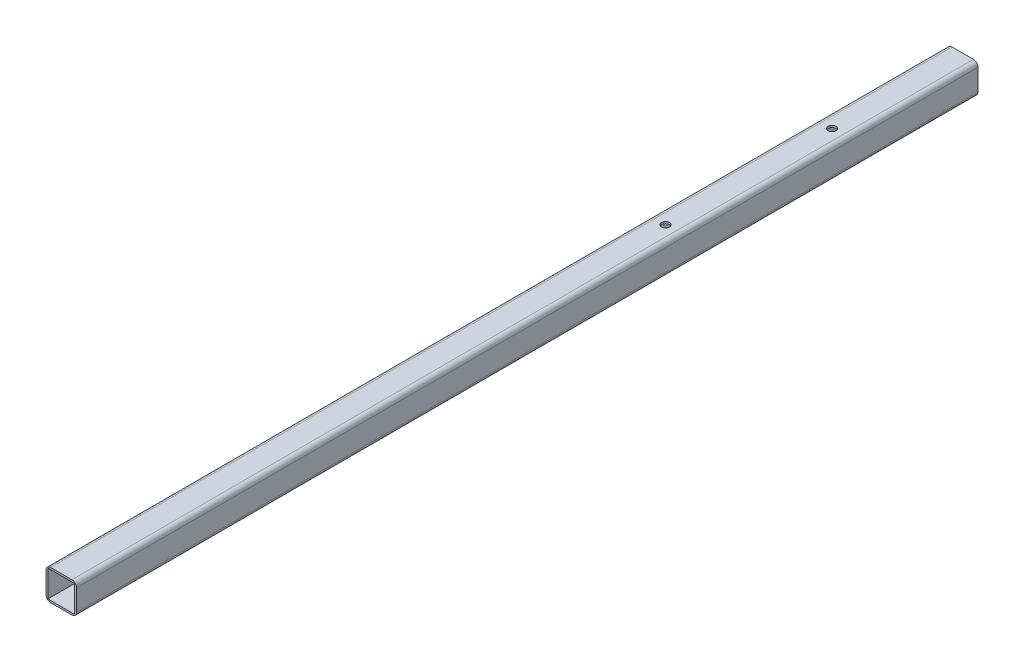
ISO-10303-21;
HEADER;
FILE_DESCRIPTION(('STEP AP214'),'2;1');
FILE_NAME('part.step','',(''),(''),'','','');
FILE_SCHEMA(('AUTOMOTIVE_DESIGN { 1 0 10303 214 1 1 1 1 }'));
ENDSEC;
DATA;
#1=APPLICATION_CONTEXT('core data for automotive mechanical design processes');
#2=APPLICATION_PROTOCOL_DEFINITION('international standard','automotive_design',2000,#1);
#3=PRODUCT_CONTEXT('',#1,'mechanical');
#4=PRODUCT('Part','Part','',(#3));
#5=PRODUCT_RELATED_PRODUCT_CATEGORY('part','',(#4));
#6=PRODUCT_DEFINITION_FORMATION('','',#4);
#7=PRODUCT_DEFINITION_CONTEXT('part definition',#1,'design');
#8=PRODUCT_DEFINITION('design','',#6,#7);
#9=PRODUCT_DEFINITION_SHAPE('','',#8);
#10=(LENGTH_UNIT() NAMED_UNIT(*) SI_UNIT(.MILLI.,.METRE.));
#11=(NAMED_UNIT(*) PLANE_ANGLE_UNIT() SI_UNIT($,.RADIAN.));
#12=(NAMED_UNIT(*) SI_UNIT($,.STERADIAN.) SOLID_ANGLE_UNIT());
#13=UNCERTAINTY_MEASURE_WITH_UNIT(LENGTH_MEASURE(1.E-05),#10,'distance_accuracy_value','');
#14=(GEOMETRIC_REPRESENTATION_CONTEXT(3) GLOBAL_UNCERTAINTY_ASSIGNED_CONTEXT((#13)) GLOBAL_UNIT_ASSIGNED_CONTEXT((#10,
#11,#12)) REPRESENTATION_CONTEXT('',''));
#15=CARTESIAN_POINT('',(0.,0.,0.));
#16=DIRECTION('',(0.,0.,1.));
#17=DIRECTION('',(1.,0.,0.));
#18=AXIS2_PLACEMENT_3D('',#15,#16,#17);
#19=CARTESIAN_POINT('',(0.,0.,374.65));
#20=DIRECTION('',(0.,0.,-1.));
#21=DIRECTION('',(-1.,0.,0.));
#22=AXIS2_PLACEMENT_3D('',#19,#20,#21);
#23=PLANE('',#22);
#24=DIRECTION('',(0.,-1.,0.));
#25=VECTOR('',#24,1.);
#26=CARTESIAN_POINT('',(-12.7,-12.7,374.65));
#27=LINE('',#26,#25);
#28=CARTESIAN_POINT('',(-12.7,8.89,374.65));
#29=VERTEX_POINT('',#28);
#30=CARTESIAN_POINT('',(-12.7,-8.89,374.65));
#31=VERTEX_POINT('',#30);
#32=EDGE_CURVE('E183',#29,#31,#27,.T.);
#33=ORIENTED_EDGE('',*,*,#32,.T.);
#34=CARTESIAN_POINT('',(-8.89,-8.89,374.65));
#35=DIRECTION('',(0.,0.,-1.));
#36=DIRECTION('',(-1.,0.,0.));
#37=AXIS2_PLACEMENT_3D('',#34,#35,#36);
#38=CIRCLE('',#37,3.81);
#39=CARTESIAN_POINT('',(-8.89,-12.7,374.65));
#40=VERTEX_POINT('',#39);
#41=EDGE_CURVE('E221',#31,#40,#38,.F.);
#42=ORIENTED_EDGE('',*,*,#41,.T.);
#43=DIRECTION('',(1.,0.,0.));
#44=VECTOR('',#43,1.);
#45=CARTESIAN_POINT('',(-12.7,-12.7,374.65));
#46=LINE('',#45,#44);
#47=CARTESIAN_POINT('',(8.89,-12.7,374.65));
#48=VERTEX_POINT('',#47);
#49=EDGE_CURVE('E186',#40,#48,#46,.T.);
#50=ORIENTED_EDGE('',*,*,#49,.T.);
#51=CARTESIAN_POINT('',(8.89,-8.89,374.65));
#52=DIRECTION('',(0.,0.,-1.));
#53=DIRECTION('',(-1.,0.,0.));
#54=AXIS2_PLACEMENT_3D('',#51,#52,#53);
#55=CIRCLE('',#54,3.81);
#56=CARTESIAN_POINT('',(12.7,-8.89,374.65));
#57=VERTEX_POINT('',#56);
#58=EDGE_CURVE('E219',#48,#57,#55,.F.);
#59=ORIENTED_EDGE('',*,*,#58,.T.);
#60=DIRECTION('',(0.,1.,0.));
#61=VECTOR('',#60,1.);
#62=CARTESIAN_POINT('',(12.7,-12.7,374.65));
#63=LINE('',#62,#61);
#64=CARTESIAN_POINT('',(12.7,8.89,374.65));
#65=VERTEX_POINT('',#64);
#66=EDGE_CURVE('E178',#57,#65,#63,.T.);
#67=ORIENTED_EDGE('',*,*,#66,.T.);
#68=CARTESIAN_POINT('',(8.89,8.89,374.65));
#69=DIRECTION('',(0.,0.,-1.));
#70=DIRECTION('',(-1.,0.,0.));
#71=AXIS2_PLACEMENT_3D('',#68,#69,#70);
#72=CIRCLE('',#71,3.81);
#73=CARTESIAN_POINT('',(8.89,12.7,374.65));
#74=VERTEX_POINT('',#73);
#75=EDGE_CURVE('E65',#65,#74,#72,.F.);
#76=ORIENTED_EDGE('',*,*,#75,.T.);
#77=DIRECTION('',(-1.,0.,0.));
#78=VECTOR('',#77,1.);
#79=CARTESIAN_POINT('',(-12.7,12.7,374.65));
#80=LINE('',#79,#78);
#81=CARTESIAN_POINT('',(-8.89,12.7,374.65));
#82=VERTEX_POINT('',#81);
#83=EDGE_CURVE('E180',#74,#82,#80,.T.);
#84=ORIENTED_EDGE('',*,*,#83,.T.);
#85=CARTESIAN_POINT('',(-8.89,8.89,374.65));
#86=DIRECTION('',(0.,0.,-1.));
#87=DIRECTION('',(-1.,0.,0.));
#88=AXIS2_PLACEMENT_3D('',#85,#86,#87);
#89=CIRCLE('',#88,3.81);
#90=EDGE_CURVE('E217',#82,#29,#89,.F.);
#91=ORIENTED_EDGE('',*,*,#90,.T.);
#92=EDGE_LOOP('',(#33,#42,#50,#59,#67,#76,#84,#91));
#93=FACE_BOUND('',#92,.T.);
#94=DIRECTION('',(0.,-1.,0.));
#95=VECTOR('',#94,1.);
#96=CARTESIAN_POINT('',(-11.1125,-11.1125,374.65));
#97=LINE('',#96,#95);
#98=CARTESIAN_POINT('',(-11.1125,11.1125,374.65));
#99=VERTEX_POINT('',#98);
#100=CARTESIAN_POINT('',(-11.1125,-11.1125,374.65));
#101=VERTEX_POINT('',#100);
#102=EDGE_CURVE('E135',#99,#101,#97,.T.);
#103=ORIENTED_EDGE('',*,*,#102,.F.);
#104=DIRECTION('',(-1.,0.,0.));
#105=VECTOR('',#104,1.);
#106=CARTESIAN_POINT('',(-11.1125,11.1125,374.65));
#107=LINE('',#106,#105);
#108=CARTESIAN_POINT('',(11.1125,11.1125,374.65));
#109=VERTEX_POINT('',#108);
#110=EDGE_CURVE('E160',#109,#99,#107,.T.);
#111=ORIENTED_EDGE('',*,*,#110,.F.);
#112=DIRECTION('',(0.,1.,0.));
#113=VECTOR('',#112,1.);
#114=CARTESIAN_POINT('',(11.1125,-11.1125,374.65));
#115=LINE('',#114,#113);
#116=CARTESIAN_POINT('',(11.1125,-11.1125,374.65));
#117=VERTEX_POINT('',#116);
#118=EDGE_CURVE('E158',#117,#109,#115,.T.);
#119=ORIENTED_EDGE('',*,*,#118,.F.);
#120=DIRECTION('',(1.,0.,0.));
#121=VECTOR('',#120,1.);
#122=CARTESIAN_POINT('',(-11.1125,-11.1125,374.65));
#123=LINE('',#122,#121);
#124=EDGE_CURVE('E145',#101,#117,#123,.T.);
#125=ORIENTED_EDGE('',*,*,#124,.F.);
#126=EDGE_LOOP('',(#103,#111,#119,#125));
#127=FACE_BOUND('',#126,.T.);
#128=ADVANCED_FACE('F43',(#93,#127),#23,.F.);
#129=CARTESIAN_POINT('',(0.,0.,-374.65));
#130=DIRECTION('',(0.,0.,-1.));
#131=DIRECTION('',(-1.,0.,0.));
#132=AXIS2_PLACEMENT_3D('',#129,#130,#131);
#133=PLANE('',#132);
#134=DIRECTION('',(1.,0.,0.));
#135=VECTOR('',#134,1.);
#136=CARTESIAN_POINT('',(-12.7,-12.7,-374.65));
#137=LINE('',#136,#135);
#138=CARTESIAN_POINT('',(-8.89,-12.7,-374.65));
#139=VERTEX_POINT('',#138);
#140=CARTESIAN_POINT('',(8.89,-12.7,-374.65));
#141=VERTEX_POINT('',#140);
#142=EDGE_CURVE('E181',#139,#141,#137,.T.);
#143=ORIENTED_EDGE('',*,*,#142,.F.);
#144=CARTESIAN_POINT('',(-8.89,-8.89,-374.65));
#145=DIRECTION('',(0.,0.,-1.));
#146=DIRECTION('',(-1.,0.,0.));
#147=AXIS2_PLACEMENT_3D('',#144,#145,#146);
#148=CIRCLE('',#147,3.81);
#149=CARTESIAN_POINT('',(-12.7,-8.89,-374.65));
#150=VERTEX_POINT('',#149);
#151=EDGE_CURVE('E209',#139,#150,#148,.T.);
#152=ORIENTED_EDGE('',*,*,#151,.T.);
#153=DIRECTION('',(0.,-1.,0.));
#154=VECTOR('',#153,1.);
#155=CARTESIAN_POINT('',(-12.7,-12.7,-374.65));
#156=LINE('',#155,#154);
#157=CARTESIAN_POINT('',(-12.7,8.89,-374.65));
#158=VERTEX_POINT('',#157);
#159=EDGE_CURVE('E194',#158,#150,#156,.T.);
#160=ORIENTED_EDGE('',*,*,#159,.F.);
#161=CARTESIAN_POINT('',(-8.89,8.89,-374.65));
#162=DIRECTION('',(0.,0.,-1.));
#163=DIRECTION('',(-1.,0.,0.));
#164=AXIS2_PLACEMENT_3D('',#161,#162,#163);
#165=CIRCLE('',#164,3.81);
#166=CARTESIAN_POINT('',(-8.89,12.7,-374.65));
#167=VERTEX_POINT('',#166);
#168=EDGE_CURVE('E205',#158,#167,#165,.T.);
#169=ORIENTED_EDGE('',*,*,#168,.T.);
#170=DIRECTION('',(-1.,0.,0.));
#171=VECTOR('',#170,1.);
#172=CARTESIAN_POINT('',(-12.7,12.7,-374.65));
#173=LINE('',#172,#171);
#174=CARTESIAN_POINT('',(8.89,12.7,-374.65));
#175=VERTEX_POINT('',#174);
#176=EDGE_CURVE('E192',#175,#167,#173,.T.);
#177=ORIENTED_EDGE('',*,*,#176,.F.);
#178=CARTESIAN_POINT('',(8.89,8.89,-374.65));
#179=DIRECTION('',(0.,0.,-1.));
#180=DIRECTION('',(-1.,0.,0.));
#181=AXIS2_PLACEMENT_3D('',#178,#179,#180);
#182=CIRCLE('',#181,3.81);
#183=CARTESIAN_POINT('',(12.7,8.89,-374.65));
#184=VERTEX_POINT('',#183);
#185=EDGE_CURVE('E203',#175,#184,#182,.T.);
#186=ORIENTED_EDGE('',*,*,#185,.T.);
#187=DIRECTION('',(0.,1.,0.));
#188=VECTOR('',#187,1.);
#189=CARTESIAN_POINT('',(12.7,-12.7,-374.65));
#190=LINE('',#189,#188);
#191=CARTESIAN_POINT('',(12.7,-8.89,-374.65));
#192=VERTEX_POINT('',#191);
#193=EDGE_CURVE('E153',#192,#184,#190,.T.);
#194=ORIENTED_EDGE('',*,*,#193,.F.);
#195=CARTESIAN_POINT('',(8.89,-8.89,-374.65));
#196=DIRECTION('',(0.,0.,-1.));
#197=DIRECTION('',(-1.,0.,0.));
#198=AXIS2_PLACEMENT_3D('',#195,#196,#197);
#199=CIRCLE('',#198,3.81);
#200=EDGE_CURVE('E207',#192,#141,#199,.T.);
#201=ORIENTED_EDGE('',*,*,#200,.T.);
#202=EDGE_LOOP('',(#143,#152,#160,#169,#177,#186,#194,#201));
#203=FACE_BOUND('',#202,.T.);
#204=DIRECTION('',(-1.,0.,0.));
#205=VECTOR('',#204,1.);
#206=CARTESIAN_POINT('',(-11.1125,11.1125,-374.65));
#207=LINE('',#206,#205);
#208=CARTESIAN_POINT('',(11.1125,11.1125,-374.65));
#209=VERTEX_POINT('',#208);
#210=CARTESIAN_POINT('',(-11.1125,11.1125,-374.65));
#211=VERTEX_POINT('',#210);
#212=EDGE_CURVE('E146',#209,#211,#207,.T.);
#213=ORIENTED_EDGE('',*,*,#212,.T.);
#214=DIRECTION('',(0.,-1.,0.));
#215=VECTOR('',#214,1.);
#216=CARTESIAN_POINT('',(-11.1125,-11.1125,-374.65));
#217=LINE('',#216,#215);
#218=CARTESIAN_POINT('',(-11.1125,-11.1125,-374.65));
#219=VERTEX_POINT('',#218);
#220=EDGE_CURVE('E165',#211,#219,#217,.T.);
#221=ORIENTED_EDGE('',*,*,#220,.T.);
#222=DIRECTION('',(1.,0.,0.));
#223=VECTOR('',#222,1.);
#224=CARTESIAN_POINT('',(-11.1125,-11.1125,-374.65));
#225=LINE('',#224,#223);
#226=CARTESIAN_POINT('',(11.1125,-11.1125,-374.65));
#227=VERTEX_POINT('',#226);
#228=EDGE_CURVE('E152',#219,#227,#225,.T.);
#229=ORIENTED_EDGE('',*,*,#228,.T.);
#230=DIRECTION('',(0.,1.,0.));
#231=VECTOR('',#230,1.);
#232=CARTESIAN_POINT('',(11.1125,-11.1125,-374.65));
#233=LINE('',#232,#231);
#234=EDGE_CURVE('E169',#227,#209,#233,.T.);
#235=ORIENTED_EDGE('',*,*,#234,.T.);
#236=EDGE_LOOP('',(#213,#221,#229,#235));
#237=FACE_BOUND('',#236,.T.);
#238=ADVANCED_FACE('F269',(#203,#237),#133,.T.);
#239=CARTESIAN_POINT('',(12.7,-12.7,374.65));
#240=DIRECTION('',(-1.,0.,0.));
#241=DIRECTION('',(0.,0.,1.));
#242=AXIS2_PLACEMENT_3D('',#239,#240,#241);
#243=PLANE('',#242);
#244=ORIENTED_EDGE('',*,*,#66,.F.);
#245=DIRECTION('',(0.,0.,-1.));
#246=VECTOR('',#245,1.);
#247=CARTESIAN_POINT('',(12.7,-8.89,374.65));
#248=LINE('',#247,#246);
#249=EDGE_CURVE('E225',#57,#192,#248,.T.);
#250=ORIENTED_EDGE('',*,*,#249,.T.);
#251=ORIENTED_EDGE('',*,*,#193,.T.);
#252=DIRECTION('',(0.,0.,-1.));
#253=VECTOR('',#252,1.);
#254=CARTESIAN_POINT('',(12.7,8.89,374.65));
#255=LINE('',#254,#253);
#256=EDGE_CURVE('E223',#184,#65,#255,.F.);
#257=ORIENTED_EDGE('',*,*,#256,.T.);
#258=EDGE_LOOP('',(#244,#250,#251,#257));
#259=FACE_BOUND('',#258,.T.);
#260=ADVANCED_FACE('F285',(#259),#243,.F.);
#261=CARTESIAN_POINT('',(-12.7,12.7,374.65));
#262=DIRECTION('',(0.,-1.,0.));
#263=DIRECTION('',(0.,0.,-1.));
#264=AXIS2_PLACEMENT_3D('',#261,#262,#263);
#265=PLANE('',#264);
#266=CARTESIAN_POINT('',(-3.33066907387547E-13,12.7,-127.595452029921));
#267=DIRECTION('',(0.,1.,0.));
#268=DIRECTION('',(0.,0.,1.));
#269=AXIS2_PLACEMENT_3D('',#266,#267,#268);
#270=CIRCLE('',#269,3.26390000000001);
#271=CARTESIAN_POINT('',(-3.33066907387547E-13,12.7,-124.331552029921));
#272=VERTEX_POINT('',#271);
#273=EDGE_CURVE('E238',#272,#272,#270,.T.);
#274=ORIENTED_EDGE('',*,*,#273,.F.);
#275=EDGE_LOOP('',(#274));
#276=FACE_BOUND('',#275,.T.);
#277=CARTESIAN_POINT('',(-2.1094237467878E-12,12.7,-266.10454797008));
#278=DIRECTION('',(0.,1.,0.));
#279=DIRECTION('',(0.,0.,1.));
#280=AXIS2_PLACEMENT_3D('',#277,#278,#279);
#281=CIRCLE('',#280,3.26390000000002);
#282=CARTESIAN_POINT('',(-2.1094237467878E-12,12.7,-262.84064797008));
#283=VERTEX_POINT('',#282);
#284=EDGE_CURVE('E243',#283,#283,#281,.T.);
#285=ORIENTED_EDGE('',*,*,#284,.F.);
#286=EDGE_LOOP('',(#285));
#287=FACE_BOUND('',#286,.T.);
#288=ORIENTED_EDGE('',*,*,#176,.T.);
#289=DIRECTION('',(0.,0.,-1.));
#290=VECTOR('',#289,1.);
#291=CARTESIAN_POINT('',(-8.89,12.7,374.65));
#292=LINE('',#291,#290);
#293=EDGE_CURVE('E11',#167,#82,#292,.F.);
#294=ORIENTED_EDGE('',*,*,#293,.T.);
#295=ORIENTED_EDGE('',*,*,#83,.F.);
#296=DIRECTION('',(0.,0.,-1.));
#297=VECTOR('',#296,1.);
#298=CARTESIAN_POINT('',(8.89,12.7,374.65));
#299=LINE('',#298,#297);
#300=EDGE_CURVE('E52',#74,#175,#299,.T.);
#301=ORIENTED_EDGE('',*,*,#300,.T.);
#302=EDGE_LOOP('',(#288,#294,#295,#301));
#303=FACE_BOUND('',#302,.T.);
#304=ADVANCED_FACE('F296',(#276,#287,#303),#265,.F.);
#305=CARTESIAN_POINT('',(-12.7,-12.7,374.65));
#306=DIRECTION('',(1.,0.,0.));
#307=DIRECTION('',(0.,0.,-1.));
#308=AXIS2_PLACEMENT_3D('',#305,#306,#307);
#309=PLANE('',#308);
#310=ORIENTED_EDGE('',*,*,#159,.T.);
#311=DIRECTION('',(0.,0.,-1.));
#312=VECTOR('',#311,1.);
#313=CARTESIAN_POINT('',(-12.7,-8.89,374.65));
#314=LINE('',#313,#312);
#315=EDGE_CURVE('E214',#150,#31,#314,.F.);
#316=ORIENTED_EDGE('',*,*,#315,.T.);
#317=ORIENTED_EDGE('',*,*,#32,.F.);
#318=DIRECTION('',(0.,0.,-1.));
#319=VECTOR('',#318,1.);
#320=CARTESIAN_POINT('',(-12.7,8.89,374.65));
#321=LINE('',#320,#319);
#322=EDGE_CURVE('E211',#29,#158,#321,.T.);
#323=ORIENTED_EDGE('',*,*,#322,.T.);
#324=EDGE_LOOP('',(#310,#316,#317,#323));
#325=FACE_BOUND('',#324,.T.);
#326=ADVANCED_FACE('F293',(#325),#309,.F.);
#327=CARTESIAN_POINT('',(-12.7,-12.7,374.65));
#328=DIRECTION('',(0.,1.,0.));
#329=DIRECTION('',(0.,0.,1.));
#330=AXIS2_PLACEMENT_3D('',#327,#328,#329);
#331=PLANE('',#330);
#332=CARTESIAN_POINT('',(-3.33066907387547E-13,-12.7,-127.595452029921));
#333=DIRECTION('',(0.,1.,0.));
#334=DIRECTION('',(0.,0.,1.));
#335=AXIS2_PLACEMENT_3D('',#332,#333,#334);
#336=CIRCLE('',#335,3.26390000000001);
#337=CARTESIAN_POINT('',(-3.33066907387547E-13,-12.7,-124.331552029921));
#338=VERTEX_POINT('',#337);
#339=EDGE_CURVE('E232',#338,#338,#336,.T.);
#340=ORIENTED_EDGE('',*,*,#339,.T.);
#341=EDGE_LOOP('',(#340));
#342=FACE_BOUND('',#341,.T.);
#343=CARTESIAN_POINT('',(-2.1094237467878E-12,-12.7,-266.10454797008));
#344=DIRECTION('',(0.,1.,0.));
#345=DIRECTION('',(0.,0.,1.));
#346=AXIS2_PLACEMENT_3D('',#343,#344,#345);
#347=CIRCLE('',#346,3.26390000000002);
#348=CARTESIAN_POINT('',(-2.1094237467878E-12,-12.7,-262.84064797008));
#349=VERTEX_POINT('',#348);
#350=EDGE_CURVE('E248',#349,#349,#347,.T.);
#351=ORIENTED_EDGE('',*,*,#350,.T.);
#352=EDGE_LOOP('',(#351));
#353=FACE_BOUND('',#352,.T.);
#354=ORIENTED_EDGE('',*,*,#49,.F.);
#355=DIRECTION('',(0.,0.,-1.));
#356=VECTOR('',#355,1.);
#357=CARTESIAN_POINT('',(-8.89,-12.7,374.65));
#358=LINE('',#357,#356);
#359=EDGE_CURVE('E200',#40,#139,#358,.T.);
#360=ORIENTED_EDGE('',*,*,#359,.T.);
#361=ORIENTED_EDGE('',*,*,#142,.T.);
#362=DIRECTION('',(0.,0.,-1.));
#363=VECTOR('',#362,1.);
#364=CARTESIAN_POINT('',(8.89,-12.7,374.65));
#365=LINE('',#364,#363);
#366=EDGE_CURVE('E189',#141,#48,#365,.F.);
#367=ORIENTED_EDGE('',*,*,#366,.T.);
#368=EDGE_LOOP('',(#354,#360,#361,#367));
#369=FACE_BOUND('',#368,.T.);
#370=ADVANCED_FACE('F290',(#342,#353,#369),#331,.F.);
#371=CARTESIAN_POINT('',(-11.1125,-11.1125,374.65));
#372=DIRECTION('',(1.,0.,0.));
#373=DIRECTION('',(0.,0.,-1.));
#374=AXIS2_PLACEMENT_3D('',#371,#372,#373);
#375=PLANE('',#374);
#376=ORIENTED_EDGE('',*,*,#220,.F.);
#377=DIRECTION('',(0.,0.,-1.));
#378=VECTOR('',#377,1.);
#379=CARTESIAN_POINT('',(-11.1125,11.1125,374.65));
#380=LINE('',#379,#378);
#381=EDGE_CURVE('E141',#99,#211,#380,.T.);
#382=ORIENTED_EDGE('',*,*,#381,.F.);
#383=ORIENTED_EDGE('',*,*,#102,.T.);
#384=DIRECTION('',(0.,0.,-1.));
#385=VECTOR('',#384,1.);
#386=CARTESIAN_POINT('',(-11.1125,-11.1125,374.65));
#387=LINE('',#386,#385);
#388=EDGE_CURVE('E138',#101,#219,#387,.T.);
#389=ORIENTED_EDGE('',*,*,#388,.T.);
#390=EDGE_LOOP('',(#376,#382,#383,#389));
#391=FACE_BOUND('',#390,.T.);
#392=ADVANCED_FACE('F137',(#391),#375,.T.);
#393=CARTESIAN_POINT('',(-11.1125,-11.1125,374.65));
#394=DIRECTION('',(0.,1.,0.));
#395=DIRECTION('',(0.,0.,1.));
#396=AXIS2_PLACEMENT_3D('',#393,#394,#395);
#397=PLANE('',#396);
#398=CARTESIAN_POINT('',(-3.33066907387547E-13,-11.1125,-127.595452029921));
#399=DIRECTION('',(0.,1.,0.));
#400=DIRECTION('',(0.,0.,1.));
#401=AXIS2_PLACEMENT_3D('',#398,#399,#400);
#402=CIRCLE('',#401,3.26390000000001);
#403=CARTESIAN_POINT('',(-3.33066907387547E-13,-11.1125,-124.331552029921));
#404=VERTEX_POINT('',#403);
#405=EDGE_CURVE('E167',#404,#404,#402,.T.);
#406=ORIENTED_EDGE('',*,*,#405,.F.);
#407=EDGE_LOOP('',(#406));
#408=FACE_BOUND('',#407,.T.);
#409=CARTESIAN_POINT('',(-2.1094237467878E-12,-11.1125,-266.10454797008));
#410=DIRECTION('',(0.,1.,0.));
#411=DIRECTION('',(0.,0.,1.));
#412=AXIS2_PLACEMENT_3D('',#409,#410,#411);
#413=CIRCLE('',#412,3.26390000000002);
#414=CARTESIAN_POINT('',(-2.1094237467878E-12,-11.1125,-262.84064797008));
#415=VERTEX_POINT('',#414);
#416=EDGE_CURVE('E231',#415,#415,#413,.T.);
#417=ORIENTED_EDGE('',*,*,#416,.F.);
#418=EDGE_LOOP('',(#417));
#419=FACE_BOUND('',#418,.T.);
#420=ORIENTED_EDGE('',*,*,#228,.F.);
#421=ORIENTED_EDGE('',*,*,#388,.F.);
#422=ORIENTED_EDGE('',*,*,#124,.T.);
#423=DIRECTION('',(0.,0.,-1.));
#424=VECTOR('',#423,1.);
#425=CARTESIAN_POINT('',(11.1125,-11.1125,374.65));
#426=LINE('',#425,#424);
#427=EDGE_CURVE('E154',#117,#227,#426,.T.);
#428=ORIENTED_EDGE('',*,*,#427,.T.);
#429=EDGE_LOOP('',(#420,#421,#422,#428));
#430=FACE_BOUND('',#429,.T.);
#431=ADVANCED_FACE('F149',(#408,#419,#430),#397,.T.);
#432=CARTESIAN_POINT('',(11.1125,-11.1125,374.65));
#433=DIRECTION('',(-1.,0.,0.));
#434=DIRECTION('',(0.,0.,1.));
#435=AXIS2_PLACEMENT_3D('',#432,#433,#434);
#436=PLANE('',#435);
#437=ORIENTED_EDGE('',*,*,#234,.F.);
#438=ORIENTED_EDGE('',*,*,#427,.F.);
#439=ORIENTED_EDGE('',*,*,#118,.T.);
#440=DIRECTION('',(0.,0.,-1.));
#441=VECTOR('',#440,1.);
#442=CARTESIAN_POINT('',(11.1125,11.1125,374.65));
#443=LINE('',#442,#441);
#444=EDGE_CURVE('E175',#109,#209,#443,.T.);
#445=ORIENTED_EDGE('',*,*,#444,.T.);
#446=EDGE_LOOP('',(#437,#438,#439,#445));
#447=FACE_BOUND('',#446,.T.);
#448=ADVANCED_FACE('F263',(#447),#436,.T.);
#449=CARTESIAN_POINT('',(-11.1125,11.1125,374.65));
#450=DIRECTION('',(0.,-1.,0.));
#451=DIRECTION('',(1.,0.,0.));
#452=AXIS2_PLACEMENT_3D('',#449,#450,#451);
#453=PLANE('',#452);
#454=CARTESIAN_POINT('',(-3.33066907387547E-13,11.1125,-127.595452029921));
#455=DIRECTION('',(0.,-1.,0.));
#456=DIRECTION('',(1.,0.,0.));
#457=AXIS2_PLACEMENT_3D('',#454,#455,#456);
#458=CIRCLE('',#457,3.26390000000001);
#459=CARTESIAN_POINT('',(3.26389999999968,11.1125,-127.595452029921));
#460=VERTEX_POINT('',#459);
#461=EDGE_CURVE('E47',#460,#460,#458,.T.);
#462=ORIENTED_EDGE('',*,*,#461,.F.);
#463=EDGE_LOOP('',(#462));
#464=FACE_BOUND('',#463,.T.);
#465=CARTESIAN_POINT('',(-2.1094237467878E-12,11.1125,-266.10454797008));
#466=DIRECTION('',(0.,-1.,0.));
#467=DIRECTION('',(1.,0.,0.));
#468=AXIS2_PLACEMENT_3D('',#465,#466,#467);
#469=CIRCLE('',#468,3.26390000000002);
#470=CARTESIAN_POINT('',(3.26389999999791,11.1125,-266.10454797008));
#471=VERTEX_POINT('',#470);
#472=EDGE_CURVE('E229',#471,#471,#469,.T.);
#473=ORIENTED_EDGE('',*,*,#472,.F.);
#474=EDGE_LOOP('',(#473));
#475=FACE_BOUND('',#474,.T.);
#476=ORIENTED_EDGE('',*,*,#212,.F.);
#477=ORIENTED_EDGE('',*,*,#444,.F.);
#478=ORIENTED_EDGE('',*,*,#110,.T.);
#479=ORIENTED_EDGE('',*,*,#381,.T.);
#480=EDGE_LOOP('',(#476,#477,#478,#479));
#481=FACE_BOUND('',#480,.T.);
#482=ADVANCED_FACE('F259',(#464,#475,#481),#453,.T.);
#483=CARTESIAN_POINT('',(-8.89,-8.89,374.65));
#484=DIRECTION('',(0.,0.,-1.));
#485=DIRECTION('',(-1.,0.,0.));
#486=AXIS2_PLACEMENT_3D('',#483,#484,#485);
#487=CYLINDRICAL_SURFACE('',#486,3.81);
#488=ORIENTED_EDGE('',*,*,#41,.F.);
#489=ORIENTED_EDGE('',*,*,#315,.F.);
#490=ORIENTED_EDGE('',*,*,#151,.F.);
#491=ORIENTED_EDGE('',*,*,#359,.F.);
#492=EDGE_LOOP('',(#488,#489,#490,#491));
#493=FACE_BOUND('',#492,.T.);
#494=ADVANCED_FACE('F262',(#493),#487,.T.);
#495=CARTESIAN_POINT('',(8.89,-8.89,374.65));
#496=DIRECTION('',(0.,0.,-1.));
#497=DIRECTION('',(-1.,0.,0.));
#498=AXIS2_PLACEMENT_3D('',#495,#496,#497);
#499=CYLINDRICAL_SURFACE('',#498,3.81);
#500=ORIENTED_EDGE('',*,*,#58,.F.);
#501=ORIENTED_EDGE('',*,*,#366,.F.);
#502=ORIENTED_EDGE('',*,*,#200,.F.);
#503=ORIENTED_EDGE('',*,*,#249,.F.);
#504=EDGE_LOOP('',(#500,#501,#502,#503));
#505=FACE_BOUND('',#504,.T.);
#506=ADVANCED_FACE('F306',(#505),#499,.T.);
#507=CARTESIAN_POINT('',(-8.89,8.89,374.65));
#508=DIRECTION('',(0.,0.,-1.));
#509=DIRECTION('',(-1.,0.,0.));
#510=AXIS2_PLACEMENT_3D('',#507,#508,#509);
#511=CYLINDRICAL_SURFACE('',#510,3.81);
#512=ORIENTED_EDGE('',*,*,#90,.F.);
#513=ORIENTED_EDGE('',*,*,#293,.F.);
#514=ORIENTED_EDGE('',*,*,#168,.F.);
#515=ORIENTED_EDGE('',*,*,#322,.F.);
#516=EDGE_LOOP('',(#512,#513,#514,#515));
#517=FACE_BOUND('',#516,.T.);
#518=ADVANCED_FACE('F309',(#517),#511,.T.);
#519=CARTESIAN_POINT('',(8.89,8.89,374.65));
#520=DIRECTION('',(0.,0.,-1.));
#521=DIRECTION('',(-1.,0.,0.));
#522=AXIS2_PLACEMENT_3D('',#519,#520,#521);
#523=CYLINDRICAL_SURFACE('',#522,3.81);
#524=ORIENTED_EDGE('',*,*,#75,.F.);
#525=ORIENTED_EDGE('',*,*,#256,.F.);
#526=ORIENTED_EDGE('',*,*,#185,.F.);
#527=ORIENTED_EDGE('',*,*,#300,.F.);
#528=EDGE_LOOP('',(#524,#525,#526,#527));
#529=FACE_BOUND('',#528,.T.);
#530=ADVANCED_FACE('F45',(#529),#523,.T.);
#531=CARTESIAN_POINT('',(-2.1094237467878E-12,-12.7,-266.10454797008));
#532=DIRECTION('',(0.,1.,0.));
#533=DIRECTION('',(0.,0.,1.));
#534=AXIS2_PLACEMENT_3D('',#531,#532,#533);
#535=CYLINDRICAL_SURFACE('',#534,3.26390000000002);
#536=ORIENTED_EDGE('',*,*,#472,.T.);
#537=EDGE_LOOP('',(#536));
#538=FACE_BOUND('',#537,.T.);
#539=ORIENTED_EDGE('',*,*,#284,.T.);
#540=EDGE_LOOP('',(#539));
#541=FACE_BOUND('',#540,.T.);
#542=ADVANCED_FACE('F316',(#538,#541),#535,.F.);
#543=CARTESIAN_POINT('',(-3.33066907387547E-13,-12.7,-127.595452029921));
#544=DIRECTION('',(0.,1.,0.));
#545=DIRECTION('',(0.,0.,1.));
#546=AXIS2_PLACEMENT_3D('',#543,#544,#545);
#547=CYLINDRICAL_SURFACE('',#546,3.26390000000001);
#548=ORIENTED_EDGE('',*,*,#461,.T.);
#549=EDGE_LOOP('',(#548));
#550=FACE_BOUND('',#549,.T.);
#551=ORIENTED_EDGE('',*,*,#273,.T.);
#552=EDGE_LOOP('',(#551));
#553=FACE_BOUND('',#552,.T.);
#554=ADVANCED_FACE('F256',(#550,#553),#547,.F.);
#555=ORIENTED_EDGE('',*,*,#416,.T.);
#556=EDGE_LOOP('',(#555));
#557=FACE_BOUND('',#556,.T.);
#558=ORIENTED_EDGE('',*,*,#350,.F.);
#559=EDGE_LOOP('',(#558));
#560=FACE_BOUND('',#559,.T.);
#561=ADVANCED_FACE('F340',(#557,#560),#535,.F.);
#562=ORIENTED_EDGE('',*,*,#405,.T.);
#563=EDGE_LOOP('',(#562));
#564=FACE_BOUND('',#563,.T.);
#565=ORIENTED_EDGE('',*,*,#339,.F.);
#566=EDGE_LOOP('',(#565));
#567=FACE_BOUND('',#566,.T.);
#568=ADVANCED_FACE('F345',(#564,#567),#547,.F.);
#569=CLOSED_SHELL('',(#128,#238,#260,#304,#326,#370,#392,#431,#448,#482,#494,#506,#518,#530,
#542,#554,#561,#568));
#570=MANIFOLD_SOLID_BREP('B2',#569);
#571=ADVANCED_BREP_SHAPE_REPRESENTATION('',(#18,#570),#14);
#572=SHAPE_DEFINITION_REPRESENTATION(#9,#571);
ENDSEC;
END-ISO-10303-21;
